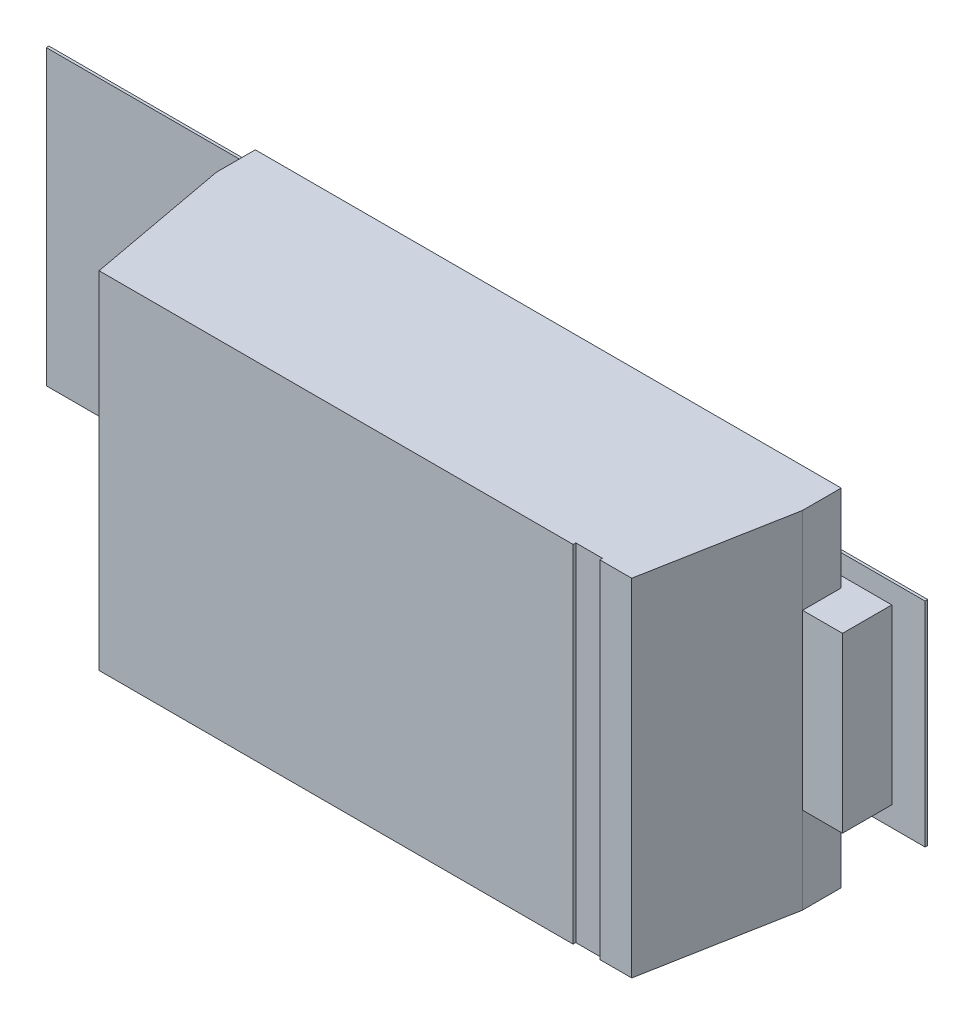
ISO-10303-21;
HEADER;
FILE_DESCRIPTION(('STEP AP214'),'2;1');
FILE_NAME('part.step','',(''),(''),'','','');
FILE_SCHEMA(('AUTOMOTIVE_DESIGN { 1 0 10303 214 1 1 1 1 }'));
ENDSEC;
DATA;
#1=APPLICATION_CONTEXT('core data for automotive mechanical design processes');
#2=APPLICATION_PROTOCOL_DEFINITION('international standard','automotive_design',2000,#1);
#3=PRODUCT_CONTEXT('',#1,'mechanical');
#4=PRODUCT('Part','Part','',(#3));
#5=PRODUCT_RELATED_PRODUCT_CATEGORY('part','',(#4));
#6=PRODUCT_DEFINITION_FORMATION('','',#4);
#7=PRODUCT_DEFINITION_CONTEXT('part definition',#1,'design');
#8=PRODUCT_DEFINITION('design','',#6,#7);
#9=PRODUCT_DEFINITION_SHAPE('','',#8);
#10=(LENGTH_UNIT() NAMED_UNIT(*) SI_UNIT(.MILLI.,.METRE.));
#11=(NAMED_UNIT(*) PLANE_ANGLE_UNIT() SI_UNIT($,.RADIAN.));
#12=(NAMED_UNIT(*) SI_UNIT($,.STERADIAN.) SOLID_ANGLE_UNIT());
#13=UNCERTAINTY_MEASURE_WITH_UNIT(LENGTH_MEASURE(1.E-05),#10,'distance_accuracy_value','');
#14=(GEOMETRIC_REPRESENTATION_CONTEXT(3) GLOBAL_UNCERTAINTY_ASSIGNED_CONTEXT((#13)) GLOBAL_UNIT_ASSIGNED_CONTEXT((#10,
#11,#12)) REPRESENTATION_CONTEXT('',''));
#15=CARTESIAN_POINT('',(0.,0.,0.));
#16=DIRECTION('',(0.,0.,1.));
#17=DIRECTION('',(1.,0.,0.));
#18=AXIS2_PLACEMENT_3D('',#15,#16,#17);
#19=CARTESIAN_POINT('',(-1.09999999999992,-0.64999999999994,0.272199999999978));
#20=DIRECTION('',(0.983318171348509,0.,-0.181893853375602));
#21=DIRECTION('',(0.,-1.,0.));
#22=AXIS2_PLACEMENT_3D('',#19,#20,#21);
#23=PLANE('',#22);
#24=DIRECTION('',(0.181893853375602,0.,0.983318171348509));
#25=VECTOR('',#24,1.);
#26=CARTESIAN_POINT('',(-1.09999999999992,0.64999999999994,0.272199999999978));
#27=LINE('',#26,#25);
#28=CARTESIAN_POINT('',(-1.09999999999992,0.64999999999994,0.272199999999978));
#29=VERTEX_POINT('',#28);
#30=CARTESIAN_POINT('',(-1.00000000000006,0.64999999999994,0.8128));
#31=VERTEX_POINT('',#30);
#32=EDGE_CURVE('E615',#29,#31,#27,.T.);
#33=ORIENTED_EDGE('',*,*,#32,.F.);
#34=DIRECTION('',(0.,-1.,0.));
#35=VECTOR('',#34,1.);
#36=CARTESIAN_POINT('',(-1.09999999999992,0.64999999999994,0.272199999999978));
#37=LINE('',#36,#35);
#38=CARTESIAN_POINT('',(-1.09999999999992,-0.64999999999994,0.272199999999978));
#39=VERTEX_POINT('',#38);
#40=EDGE_CURVE('E343',#29,#39,#37,.T.);
#41=ORIENTED_EDGE('',*,*,#40,.T.);
#42=DIRECTION('',(0.181893853375602,0.,0.983318171348509));
#43=VECTOR('',#42,1.);
#44=CARTESIAN_POINT('',(-1.09999999999992,-0.64999999999994,0.272199999999978));
#45=LINE('',#44,#43);
#46=CARTESIAN_POINT('',(-1.00000000000006,-0.64999999999994,0.8128));
#47=VERTEX_POINT('',#46);
#48=EDGE_CURVE('E384',#39,#47,#45,.T.);
#49=ORIENTED_EDGE('',*,*,#48,.T.);
#50=DIRECTION('',(0.,1.,0.));
#51=VECTOR('',#50,1.);
#52=CARTESIAN_POINT('',(-1.00000000000006,-0.64999999999994,0.8128));
#53=LINE('',#52,#51);
#54=EDGE_CURVE('E380',#47,#31,#53,.T.);
#55=ORIENTED_EDGE('',*,*,#54,.T.);
#56=EDGE_LOOP('',(#33,#41,#49,#55));
#57=FACE_BOUND('',#56,.T.);
#58=ADVANCED_FACE('F17',(#57),#23,.F.);
#59=CARTESIAN_POINT('',(1.25000000000008,-0.32499999999997,0.0762));
#60=DIRECTION('',(1.,0.,0.));
#61=DIRECTION('',(0.,1.,0.));
#62=AXIS2_PLACEMENT_3D('',#59,#60,#61);
#63=PLANE('',#62);
#64=DIRECTION('',(0.,1.,0.));
#65=VECTOR('',#64,1.);
#66=CARTESIAN_POINT('',(1.25000000000008,-0.32499999999997,0.0862000000000108));
#67=LINE('',#66,#65);
#68=CARTESIAN_POINT('',(1.25000000000008,-0.32499999999997,0.0862000000000108));
#69=VERTEX_POINT('',#68);
#70=CARTESIAN_POINT('',(1.25000000000008,0.32499999999997,0.0862000000000108));
#71=VERTEX_POINT('',#70);
#72=EDGE_CURVE('E312',#69,#71,#67,.T.);
#73=ORIENTED_EDGE('',*,*,#72,.T.);
#74=DIRECTION('',(0.,0.,1.));
#75=VECTOR('',#74,1.);
#76=CARTESIAN_POINT('',(1.25000000000008,0.32499999999997,0.0862000000000108));
#77=LINE('',#76,#75);
#78=CARTESIAN_POINT('',(1.25000000000008,0.32499999999997,0.271199999999982));
#79=VERTEX_POINT('',#78);
#80=EDGE_CURVE('E11',#71,#79,#77,.T.);
#81=ORIENTED_EDGE('',*,*,#80,.T.);
#82=DIRECTION('',(0.,1.,0.));
#83=VECTOR('',#82,1.);
#84=CARTESIAN_POINT('',(1.25000000000008,-0.32499999999997,0.271199999999982));
#85=LINE('',#84,#83);
#86=CARTESIAN_POINT('',(1.25000000000008,-0.32499999999997,0.271199999999982));
#87=VERTEX_POINT('',#86);
#88=EDGE_CURVE('E479',#87,#79,#85,.T.);
#89=ORIENTED_EDGE('',*,*,#88,.F.);
#90=DIRECTION('',(0.,0.,1.));
#91=VECTOR('',#90,1.);
#92=CARTESIAN_POINT('',(1.25000000000008,-0.32499999999997,0.0862000000000108));
#93=LINE('',#92,#91);
#94=EDGE_CURVE('E315',#69,#87,#93,.T.);
#95=ORIENTED_EDGE('',*,*,#94,.F.);
#96=EDGE_LOOP('',(#73,#81,#89,#95));
#97=FACE_BOUND('',#96,.T.);
#98=ADVANCED_FACE('F666',(#97),#63,.T.);
#99=CARTESIAN_POINT('',(1.25000000000008,0.32499999999997,0.0762));
#100=DIRECTION('',(0.,1.,0.));
#101=DIRECTION('',(1.,0.,0.));
#102=AXIS2_PLACEMENT_3D('',#99,#100,#101);
#103=PLANE('',#102);
#104=DIRECTION('',(-1.,0.,0.));
#105=VECTOR('',#104,1.);
#106=CARTESIAN_POINT('',(1.25000000000008,0.32499999999997,0.0862000000000108));
#107=LINE('',#106,#105);
#108=CARTESIAN_POINT('',(0.599999999999886,0.32499999999997,0.0862000000000108));
#109=VERTEX_POINT('',#108);
#110=EDGE_CURVE('E300',#71,#109,#107,.T.);
#111=ORIENTED_EDGE('',*,*,#110,.T.);
#112=DIRECTION('',(0.,0.,1.));
#113=VECTOR('',#112,1.);
#114=CARTESIAN_POINT('',(0.599999999999886,0.32499999999997,0.0862000000000108));
#115=LINE('',#114,#113);
#116=CARTESIAN_POINT('',(0.599999999999886,0.32499999999997,0.126200000000003));
#117=VERTEX_POINT('',#116);
#118=EDGE_CURVE('E28',#109,#117,#115,.T.);
#119=ORIENTED_EDGE('',*,*,#118,.T.);
#120=DIRECTION('',(-1.,0.,0.));
#121=VECTOR('',#120,1.);
#122=CARTESIAN_POINT('',(1.09999999999992,0.32499999999997,0.126200000000003));
#123=LINE('',#122,#121);
#124=CARTESIAN_POINT('',(1.09999999999992,0.32499999999997,0.126200000000003));
#125=VERTEX_POINT('',#124);
#126=EDGE_CURVE('E491',#125,#117,#123,.T.);
#127=ORIENTED_EDGE('',*,*,#126,.F.);
#128=DIRECTION('',(0.,0.,1.));
#129=VECTOR('',#128,1.);
#130=CARTESIAN_POINT('',(1.09999999999992,0.32499999999997,0.126200000000003));
#131=LINE('',#130,#129);
#132=CARTESIAN_POINT('',(1.09999999999992,0.32499999999997,0.271199999999982));
#133=VERTEX_POINT('',#132);
#134=EDGE_CURVE('E413',#125,#133,#131,.T.);
#135=ORIENTED_EDGE('',*,*,#134,.T.);
#136=DIRECTION('',(-1.,0.,0.));
#137=VECTOR('',#136,1.);
#138=CARTESIAN_POINT('',(1.25000000000008,0.32499999999997,0.271199999999982));
#139=LINE('',#138,#137);
#140=EDGE_CURVE('E344',#79,#133,#139,.T.);
#141=ORIENTED_EDGE('',*,*,#140,.F.);
#142=ORIENTED_EDGE('',*,*,#80,.F.);
#143=EDGE_LOOP('',(#111,#119,#127,#135,#141,#142));
#144=FACE_BOUND('',#143,.T.);
#145=ADVANCED_FACE('F19',(#144),#103,.T.);
#146=CARTESIAN_POINT('',(0.599999999999886,0.32499999999997,0.0762));
#147=DIRECTION('',(-1.,0.,0.));
#148=DIRECTION('',(0.,0.,1.));
#149=AXIS2_PLACEMENT_3D('',#146,#147,#148);
#150=PLANE('',#149);
#151=DIRECTION('',(0.,-1.,0.));
#152=VECTOR('',#151,1.);
#153=CARTESIAN_POINT('',(0.599999999999886,0.32499999999997,0.0862000000000108));
#154=LINE('',#153,#152);
#155=CARTESIAN_POINT('',(0.599999999999886,-0.32499999999997,0.0862000000000108));
#156=VERTEX_POINT('',#155);
#157=EDGE_CURVE('E292',#109,#156,#154,.T.);
#158=ORIENTED_EDGE('',*,*,#157,.T.);
#159=DIRECTION('',(0.,0.,1.));
#160=VECTOR('',#159,1.);
#161=CARTESIAN_POINT('',(0.599999999999886,-0.32499999999997,0.0862000000000108));
#162=LINE('',#161,#160);
#163=CARTESIAN_POINT('',(0.599999999999886,-0.32499999999997,0.126200000000003));
#164=VERTEX_POINT('',#163);
#165=EDGE_CURVE('E295',#156,#164,#162,.T.);
#166=ORIENTED_EDGE('',*,*,#165,.T.);
#167=DIRECTION('',(0.,-1.,0.));
#168=VECTOR('',#167,1.);
#169=CARTESIAN_POINT('',(0.599999999999886,0.32499999999997,0.126200000000003));
#170=LINE('',#169,#168);
#171=EDGE_CURVE('E561',#117,#164,#170,.T.);
#172=ORIENTED_EDGE('',*,*,#171,.F.);
#173=ORIENTED_EDGE('',*,*,#118,.F.);
#174=EDGE_LOOP('',(#158,#166,#172,#173));
#175=FACE_BOUND('',#174,.T.);
#176=ADVANCED_FACE('F294',(#175),#150,.T.);
#177=CARTESIAN_POINT('',(1.09999999999992,-0.64999999999994,0.126200000000003));
#178=DIRECTION('',(0.,0.,1.));
#179=DIRECTION('',(1.,0.,0.));
#180=AXIS2_PLACEMENT_3D('',#177,#178,#179);
#181=PLANE('',#180);
#182=DIRECTION('',(1.,0.,0.));
#183=VECTOR('',#182,1.);
#184=CARTESIAN_POINT('',(-1.09999999999992,-0.32499999999997,0.126200000000003));
#185=LINE('',#184,#183);
#186=CARTESIAN_POINT('',(-1.09999999999992,-0.32499999999997,0.126200000000003));
#187=VERTEX_POINT('',#186);
#188=CARTESIAN_POINT('',(0.0500000000000032,-0.32499999999997,0.126200000000003));
#189=VERTEX_POINT('',#188);
#190=EDGE_CURVE('E349',#187,#189,#185,.T.);
#191=ORIENTED_EDGE('',*,*,#190,.T.);
#192=DIRECTION('',(0.,1.,0.));
#193=VECTOR('',#192,1.);
#194=CARTESIAN_POINT('',(0.0500000000000032,-0.32499999999997,0.126200000000003));
#195=LINE('',#194,#193);
#196=CARTESIAN_POINT('',(0.0500000000000032,0.32499999999997,0.126200000000003));
#197=VERTEX_POINT('',#196);
#198=EDGE_CURVE('E350',#189,#197,#195,.T.);
#199=ORIENTED_EDGE('',*,*,#198,.T.);
#200=DIRECTION('',(1.,0.,0.));
#201=VECTOR('',#200,1.);
#202=CARTESIAN_POINT('',(-1.09999999999992,0.32499999999997,0.126200000000003));
#203=LINE('',#202,#201);
#204=CARTESIAN_POINT('',(-1.09999999999992,0.32499999999997,0.126200000000003));
#205=VERTEX_POINT('',#204);
#206=EDGE_CURVE('E431',#205,#197,#203,.T.);
#207=ORIENTED_EDGE('',*,*,#206,.F.);
#208=DIRECTION('',(0.,-1.,0.));
#209=VECTOR('',#208,1.);
#210=CARTESIAN_POINT('',(-1.09999999999992,0.64999999999994,0.126200000000003));
#211=LINE('',#210,#209);
#212=CARTESIAN_POINT('',(-1.09999999999992,0.64999999999994,0.126200000000003));
#213=VERTEX_POINT('',#212);
#214=EDGE_CURVE('E482',#213,#205,#211,.T.);
#215=ORIENTED_EDGE('',*,*,#214,.F.);
#216=DIRECTION('',(-1.,0.,0.));
#217=VECTOR('',#216,1.);
#218=CARTESIAN_POINT('',(1.09999999999992,0.64999999999994,0.126200000000003));
#219=LINE('',#218,#217);
#220=CARTESIAN_POINT('',(1.09999999999992,0.64999999999994,0.126200000000003));
#221=VERTEX_POINT('',#220);
#222=EDGE_CURVE('E487',#221,#213,#219,.T.);
#223=ORIENTED_EDGE('',*,*,#222,.F.);
#224=DIRECTION('',(0.,1.,0.));
#225=VECTOR('',#224,1.);
#226=CARTESIAN_POINT('',(1.09999999999992,0.32499999999997,0.126200000000003));
#227=LINE('',#226,#225);
#228=EDGE_CURVE('E324',#125,#221,#227,.T.);
#229=ORIENTED_EDGE('',*,*,#228,.F.);
#230=ORIENTED_EDGE('',*,*,#126,.T.);
#231=ORIENTED_EDGE('',*,*,#171,.T.);
#232=DIRECTION('',(-1.,0.,0.));
#233=VECTOR('',#232,1.);
#234=CARTESIAN_POINT('',(1.09999999999992,-0.32499999999997,0.126200000000003));
#235=LINE('',#234,#233);
#236=CARTESIAN_POINT('',(1.09999999999992,-0.32499999999997,0.126200000000003));
#237=VERTEX_POINT('',#236);
#238=EDGE_CURVE('E284',#237,#164,#235,.T.);
#239=ORIENTED_EDGE('',*,*,#238,.F.);
#240=DIRECTION('',(0.,1.,0.));
#241=VECTOR('',#240,1.);
#242=CARTESIAN_POINT('',(1.09999999999992,-0.64999999999994,0.126200000000003));
#243=LINE('',#242,#241);
#244=CARTESIAN_POINT('',(1.09999999999992,-0.64999999999994,0.126200000000003));
#245=VERTEX_POINT('',#244);
#246=EDGE_CURVE('E316',#245,#237,#243,.T.);
#247=ORIENTED_EDGE('',*,*,#246,.F.);
#248=DIRECTION('',(1.,0.,0.));
#249=VECTOR('',#248,1.);
#250=CARTESIAN_POINT('',(-1.09999999999992,-0.64999999999994,0.126200000000003));
#251=LINE('',#250,#249);
#252=CARTESIAN_POINT('',(-1.09999999999992,-0.64999999999994,0.126200000000003));
#253=VERTEX_POINT('',#252);
#254=EDGE_CURVE('E362',#253,#245,#251,.T.);
#255=ORIENTED_EDGE('',*,*,#254,.F.);
#256=DIRECTION('',(0.,-1.,0.));
#257=VECTOR('',#256,1.);
#258=CARTESIAN_POINT('',(-1.09999999999992,-0.32499999999997,0.126200000000003));
#259=LINE('',#258,#257);
#260=EDGE_CURVE('E340',#187,#253,#259,.T.);
#261=ORIENTED_EDGE('',*,*,#260,.F.);
#262=EDGE_LOOP('',(#191,#199,#207,#215,#223,#229,#230,#231,#239,#247,#255,#261));
#263=FACE_BOUND('',#262,.T.);
#264=ADVANCED_FACE('F646',(#263),#181,.F.);
#265=CARTESIAN_POINT('',(-1.09999999999992,0.64999999999994,0.0762));
#266=DIRECTION('',(-1.,0.,0.));
#267=DIRECTION('',(0.,0.,1.));
#268=AXIS2_PLACEMENT_3D('',#265,#266,#267);
#269=PLANE('',#268);
#270=DIRECTION('',(0.,0.,1.));
#271=VECTOR('',#270,1.);
#272=CARTESIAN_POINT('',(-1.09999999999992,-0.32499999999997,0.126200000000003));
#273=LINE('',#272,#271);
#274=CARTESIAN_POINT('',(-1.09999999999992,-0.32499999999997,0.271199999999982));
#275=VERTEX_POINT('',#274);
#276=EDGE_CURVE('E476',#187,#275,#273,.T.);
#277=ORIENTED_EDGE('',*,*,#276,.F.);
#278=ORIENTED_EDGE('',*,*,#260,.T.);
#279=DIRECTION('',(0.,0.,1.));
#280=VECTOR('',#279,1.);
#281=CARTESIAN_POINT('',(-1.09999999999992,-0.64999999999994,0.126200000000003));
#282=LINE('',#281,#280);
#283=EDGE_CURVE('E390',#253,#39,#282,.T.);
#284=ORIENTED_EDGE('',*,*,#283,.T.);
#285=ORIENTED_EDGE('',*,*,#40,.F.);
#286=DIRECTION('',(0.,0.,1.));
#287=VECTOR('',#286,1.);
#288=CARTESIAN_POINT('',(-1.09999999999992,0.64999999999994,0.126200000000003));
#289=LINE('',#288,#287);
#290=EDGE_CURVE('E596',#213,#29,#289,.T.);
#291=ORIENTED_EDGE('',*,*,#290,.F.);
#292=ORIENTED_EDGE('',*,*,#214,.T.);
#293=DIRECTION('',(0.,0.,1.));
#294=VECTOR('',#293,1.);
#295=CARTESIAN_POINT('',(-1.09999999999992,0.32499999999997,0.126200000000003));
#296=LINE('',#295,#294);
#297=CARTESIAN_POINT('',(-1.09999999999992,0.32499999999997,0.271199999999982));
#298=VERTEX_POINT('',#297);
#299=EDGE_CURVE('E427',#205,#298,#296,.T.);
#300=ORIENTED_EDGE('',*,*,#299,.T.);
#301=DIRECTION('',(0.,1.,0.));
#302=VECTOR('',#301,1.);
#303=CARTESIAN_POINT('',(-1.09999999999992,-0.32499999999997,0.271199999999982));
#304=LINE('',#303,#302);
#305=EDGE_CURVE('E569',#275,#298,#304,.T.);
#306=ORIENTED_EDGE('',*,*,#305,.F.);
#307=EDGE_LOOP('',(#277,#278,#284,#285,#291,#292,#300,#306));
#308=FACE_BOUND('',#307,.T.);
#309=ADVANCED_FACE('F641',(#308),#269,.T.);
#310=CARTESIAN_POINT('',(0.,0.,0.271199999999982));
#311=DIRECTION('',(0.,0.,1.));
#312=DIRECTION('',(1.,0.,0.));
#313=AXIS2_PLACEMENT_3D('',#310,#311,#312);
#314=PLANE('',#313);
#315=DIRECTION('',(1.,0.,0.));
#316=VECTOR('',#315,1.);
#317=CARTESIAN_POINT('',(1.09999999999992,-0.32499999999997,0.271199999999982));
#318=LINE('',#317,#316);
#319=CARTESIAN_POINT('',(1.09999999999992,-0.32499999999997,0.271199999999982));
#320=VERTEX_POINT('',#319);
#321=EDGE_CURVE('E270',#320,#87,#318,.T.);
#322=ORIENTED_EDGE('',*,*,#321,.T.);
#323=ORIENTED_EDGE('',*,*,#88,.T.);
#324=ORIENTED_EDGE('',*,*,#140,.T.);
#325=DIRECTION('',(0.,1.,0.));
#326=VECTOR('',#325,1.);
#327=CARTESIAN_POINT('',(1.09999999999992,-0.32499999999997,0.271199999999982));
#328=LINE('',#327,#326);
#329=EDGE_CURVE('E435',#320,#133,#328,.T.);
#330=ORIENTED_EDGE('',*,*,#329,.F.);
#331=EDGE_LOOP('',(#322,#323,#324,#330));
#332=FACE_BOUND('',#331,.T.);
#333=ADVANCED_FACE('F681',(#332),#314,.T.);
#334=CARTESIAN_POINT('',(0.,0.,0.271199999999982));
#335=DIRECTION('',(0.,0.,1.));
#336=DIRECTION('',(1.,0.,0.));
#337=AXIS2_PLACEMENT_3D('',#334,#335,#336);
#338=PLANE('',#337);
#339=DIRECTION('',(1.,0.,0.));
#340=VECTOR('',#339,1.);
#341=CARTESIAN_POINT('',(-1.25000000000008,-0.32499999999997,0.271199999999982));
#342=LINE('',#341,#340);
#343=CARTESIAN_POINT('',(-1.25000000000008,-0.32499999999997,0.271199999999982));
#344=VERTEX_POINT('',#343);
#345=EDGE_CURVE('E571',#344,#275,#342,.T.);
#346=ORIENTED_EDGE('',*,*,#345,.T.);
#347=ORIENTED_EDGE('',*,*,#305,.T.);
#348=DIRECTION('',(-1.,0.,0.));
#349=VECTOR('',#348,1.);
#350=CARTESIAN_POINT('',(-1.09999999999992,0.32499999999997,0.271199999999982));
#351=LINE('',#350,#349);
#352=CARTESIAN_POINT('',(-1.25000000000008,0.32499999999997,0.271199999999982));
#353=VERTEX_POINT('',#352);
#354=EDGE_CURVE('E370',#298,#353,#351,.T.);
#355=ORIENTED_EDGE('',*,*,#354,.T.);
#356=DIRECTION('',(0.,-1.,0.));
#357=VECTOR('',#356,1.);
#358=CARTESIAN_POINT('',(-1.25000000000008,0.32499999999997,0.271199999999982));
#359=LINE('',#358,#357);
#360=EDGE_CURVE('E371',#353,#344,#359,.T.);
#361=ORIENTED_EDGE('',*,*,#360,.T.);
#362=EDGE_LOOP('',(#346,#347,#355,#361));
#363=FACE_BOUND('',#362,.T.);
#364=ADVANCED_FACE('F678',(#363),#338,.T.);
#365=CARTESIAN_POINT('',(-1.25000000000008,-0.32499999999997,0.0762));
#366=DIRECTION('',(0.,-1.,0.));
#367=DIRECTION('',(0.,0.,-1.));
#368=AXIS2_PLACEMENT_3D('',#365,#366,#367);
#369=PLANE('',#368);
#370=DIRECTION('',(1.,0.,0.));
#371=VECTOR('',#370,1.);
#372=CARTESIAN_POINT('',(-1.25000000000008,-0.32499999999997,0.0862000000000108));
#373=LINE('',#372,#371);
#374=CARTESIAN_POINT('',(-1.25000000000008,-0.32499999999997,0.0862000000000108));
#375=VERTEX_POINT('',#374);
#376=CARTESIAN_POINT('',(0.0500000000000032,-0.32499999999997,0.0862000000000108));
#377=VERTEX_POINT('',#376);
#378=EDGE_CURVE('E459',#375,#377,#373,.T.);
#379=ORIENTED_EDGE('',*,*,#378,.T.);
#380=DIRECTION('',(0.,0.,1.));
#381=VECTOR('',#380,1.);
#382=CARTESIAN_POINT('',(0.0500000000000032,-0.32499999999997,0.0862000000000108));
#383=LINE('',#382,#381);
#384=EDGE_CURVE('E345',#377,#189,#383,.T.);
#385=ORIENTED_EDGE('',*,*,#384,.T.);
#386=ORIENTED_EDGE('',*,*,#190,.F.);
#387=ORIENTED_EDGE('',*,*,#276,.T.);
#388=ORIENTED_EDGE('',*,*,#345,.F.);
#389=DIRECTION('',(0.,0.,1.));
#390=VECTOR('',#389,1.);
#391=CARTESIAN_POINT('',(-1.25000000000008,-0.32499999999997,0.0862000000000108));
#392=LINE('',#391,#390);
#393=EDGE_CURVE('E612',#375,#344,#392,.T.);
#394=ORIENTED_EDGE('',*,*,#393,.F.);
#395=EDGE_LOOP('',(#379,#385,#386,#387,#388,#394));
#396=FACE_BOUND('',#395,.T.);
#397=ADVANCED_FACE('F656',(#396),#369,.T.);
#398=CARTESIAN_POINT('',(0.0500000000000032,-0.32499999999997,0.0762));
#399=DIRECTION('',(1.,0.,0.));
#400=DIRECTION('',(0.,1.,0.));
#401=AXIS2_PLACEMENT_3D('',#398,#399,#400);
#402=PLANE('',#401);
#403=DIRECTION('',(0.,1.,0.));
#404=VECTOR('',#403,1.);
#405=CARTESIAN_POINT('',(0.0500000000000032,-0.32499999999997,0.0862000000000108));
#406=LINE('',#405,#404);
#407=CARTESIAN_POINT('',(0.0500000000000032,0.32499999999997,0.0862000000000108));
#408=VERTEX_POINT('',#407);
#409=EDGE_CURVE('E542',#377,#408,#406,.T.);
#410=ORIENTED_EDGE('',*,*,#409,.T.);
#411=DIRECTION('',(0.,0.,1.));
#412=VECTOR('',#411,1.);
#413=CARTESIAN_POINT('',(0.0500000000000032,0.32499999999997,0.0862000000000108));
#414=LINE('',#413,#412);
#415=EDGE_CURVE('E416',#408,#197,#414,.T.);
#416=ORIENTED_EDGE('',*,*,#415,.T.);
#417=ORIENTED_EDGE('',*,*,#198,.F.);
#418=ORIENTED_EDGE('',*,*,#384,.F.);
#419=EDGE_LOOP('',(#410,#416,#417,#418));
#420=FACE_BOUND('',#419,.T.);
#421=ADVANCED_FACE('F741',(#420),#402,.T.);
#422=CARTESIAN_POINT('',(0.0500000000000032,0.32499999999997,0.0762));
#423=DIRECTION('',(0.,1.,0.));
#424=DIRECTION('',(1.,0.,0.));
#425=AXIS2_PLACEMENT_3D('',#422,#423,#424);
#426=PLANE('',#425);
#427=DIRECTION('',(-1.,0.,0.));
#428=VECTOR('',#427,1.);
#429=CARTESIAN_POINT('',(0.0500000000000032,0.32499999999997,0.0862000000000108));
#430=LINE('',#429,#428);
#431=CARTESIAN_POINT('',(-1.25000000000008,0.32499999999997,0.0862000000000108));
#432=VERTEX_POINT('',#431);
#433=EDGE_CURVE('E533',#408,#432,#430,.T.);
#434=ORIENTED_EDGE('',*,*,#433,.T.);
#435=DIRECTION('',(0.,0.,1.));
#436=VECTOR('',#435,1.);
#437=CARTESIAN_POINT('',(-1.25000000000008,0.32499999999997,0.0862000000000108));
#438=LINE('',#437,#436);
#439=EDGE_CURVE('E367',#432,#353,#438,.T.);
#440=ORIENTED_EDGE('',*,*,#439,.T.);
#441=ORIENTED_EDGE('',*,*,#354,.F.);
#442=ORIENTED_EDGE('',*,*,#299,.F.);
#443=ORIENTED_EDGE('',*,*,#206,.T.);
#444=ORIENTED_EDGE('',*,*,#415,.F.);
#445=EDGE_LOOP('',(#434,#440,#441,#442,#443,#444));
#446=FACE_BOUND('',#445,.T.);
#447=ADVANCED_FACE('F652',(#446),#426,.T.);
#448=CARTESIAN_POINT('',(-1.25000000000008,0.32499999999997,0.0762));
#449=DIRECTION('',(-1.,0.,0.));
#450=DIRECTION('',(0.,0.,1.));
#451=AXIS2_PLACEMENT_3D('',#448,#449,#450);
#452=PLANE('',#451);
#453=DIRECTION('',(0.,-1.,0.));
#454=VECTOR('',#453,1.);
#455=CARTESIAN_POINT('',(-1.25000000000008,0.32499999999997,0.0862000000000108));
#456=LINE('',#455,#454);
#457=EDGE_CURVE('E525',#432,#375,#456,.T.);
#458=ORIENTED_EDGE('',*,*,#457,.T.);
#459=ORIENTED_EDGE('',*,*,#393,.T.);
#460=ORIENTED_EDGE('',*,*,#360,.F.);
#461=ORIENTED_EDGE('',*,*,#439,.F.);
#462=EDGE_LOOP('',(#458,#459,#460,#461));
#463=FACE_BOUND('',#462,.T.);
#464=ADVANCED_FACE('F724',(#463),#452,.T.);
#465=CARTESIAN_POINT('',(1.37500000000009,0.399999999999924,0.0762));
#466=DIRECTION('',(0.,1.,0.));
#467=DIRECTION('',(1.,0.,0.));
#468=AXIS2_PLACEMENT_3D('',#465,#466,#467);
#469=PLANE('',#468);
#470=DIRECTION('',(-1.,0.,0.));
#471=VECTOR('',#470,1.);
#472=CARTESIAN_POINT('',(1.37500000000009,0.399999999999924,0.0762));
#473=LINE('',#472,#471);
#474=CARTESIAN_POINT('',(1.37500000000009,0.399999999999924,0.0762));
#475=VERTEX_POINT('',#474);
#476=CARTESIAN_POINT('',(0.574999999999986,0.399999999999924,0.0762));
#477=VERTEX_POINT('',#476);
#478=EDGE_CURVE('E334',#475,#477,#473,.T.);
#479=ORIENTED_EDGE('',*,*,#478,.T.);
#480=DIRECTION('',(0.,0.,1.));
#481=VECTOR('',#480,1.);
#482=CARTESIAN_POINT('',(0.574999999999986,0.399999999999924,0.0762));
#483=LINE('',#482,#481);
#484=CARTESIAN_POINT('',(0.574999999999986,0.399999999999924,0.0862000000000108));
#485=VERTEX_POINT('',#484);
#486=EDGE_CURVE('E437',#477,#485,#483,.T.);
#487=ORIENTED_EDGE('',*,*,#486,.T.);
#488=DIRECTION('',(-1.,0.,0.));
#489=VECTOR('',#488,1.);
#490=CARTESIAN_POINT('',(1.37500000000009,0.399999999999924,0.0862000000000108));
#491=LINE('',#490,#489);
#492=CARTESIAN_POINT('',(1.37500000000009,0.399999999999924,0.0862000000000108));
#493=VERTEX_POINT('',#492);
#494=EDGE_CURVE('E301',#493,#485,#491,.T.);
#495=ORIENTED_EDGE('',*,*,#494,.F.);
#496=DIRECTION('',(0.,0.,1.));
#497=VECTOR('',#496,1.);
#498=CARTESIAN_POINT('',(1.37500000000009,0.399999999999924,0.0762));
#499=LINE('',#498,#497);
#500=EDGE_CURVE('E189',#475,#493,#499,.T.);
#501=ORIENTED_EDGE('',*,*,#500,.F.);
#502=EDGE_LOOP('',(#479,#487,#495,#501));
#503=FACE_BOUND('',#502,.T.);
#504=ADVANCED_FACE('F712',(#503),#469,.T.);
#505=CARTESIAN_POINT('',(1.37500000000009,-0.399999999999924,0.0762));
#506=DIRECTION('',(1.,0.,0.));
#507=DIRECTION('',(0.,1.,0.));
#508=AXIS2_PLACEMENT_3D('',#505,#506,#507);
#509=PLANE('',#508);
#510=DIRECTION('',(0.,1.,0.));
#511=VECTOR('',#510,1.);
#512=CARTESIAN_POINT('',(1.37500000000009,-0.399999999999924,0.0762));
#513=LINE('',#512,#511);
#514=CARTESIAN_POINT('',(1.37500000000009,-0.399999999999924,0.0762));
#515=VERTEX_POINT('',#514);
#516=EDGE_CURVE('E417',#515,#475,#513,.T.);
#517=ORIENTED_EDGE('',*,*,#516,.T.);
#518=ORIENTED_EDGE('',*,*,#500,.T.);
#519=DIRECTION('',(0.,1.,0.));
#520=VECTOR('',#519,1.);
#521=CARTESIAN_POINT('',(1.37500000000009,-0.399999999999924,0.0862000000000108));
#522=LINE('',#521,#520);
#523=CARTESIAN_POINT('',(1.37500000000009,-0.399999999999924,0.0862000000000108));
#524=VERTEX_POINT('',#523);
#525=EDGE_CURVE('E366',#524,#493,#522,.T.);
#526=ORIENTED_EDGE('',*,*,#525,.F.);
#527=DIRECTION('',(0.,0.,1.));
#528=VECTOR('',#527,1.);
#529=CARTESIAN_POINT('',(1.37500000000009,-0.399999999999924,0.0762));
#530=LINE('',#529,#528);
#531=EDGE_CURVE('E591',#515,#524,#530,.T.);
#532=ORIENTED_EDGE('',*,*,#531,.F.);
#533=EDGE_LOOP('',(#517,#518,#526,#532));
#534=FACE_BOUND('',#533,.T.);
#535=ADVANCED_FACE('F709',(#534),#509,.T.);
#536=CARTESIAN_POINT('',(0.574999999999986,-0.399999999999924,0.0762));
#537=DIRECTION('',(0.,-1.,0.));
#538=DIRECTION('',(0.,0.,-1.));
#539=AXIS2_PLACEMENT_3D('',#536,#537,#538);
#540=PLANE('',#539);
#541=DIRECTION('',(1.,0.,0.));
#542=VECTOR('',#541,1.);
#543=CARTESIAN_POINT('',(0.574999999999986,-0.399999999999924,0.0762));
#544=LINE('',#543,#542);
#545=CARTESIAN_POINT('',(0.574999999999986,-0.399999999999924,0.0762));
#546=VERTEX_POINT('',#545);
#547=EDGE_CURVE('E420',#546,#515,#544,.T.);
#548=ORIENTED_EDGE('',*,*,#547,.T.);
#549=ORIENTED_EDGE('',*,*,#531,.T.);
#550=DIRECTION('',(1.,0.,0.));
#551=VECTOR('',#550,1.);
#552=CARTESIAN_POINT('',(0.574999999999986,-0.399999999999924,0.0862000000000108));
#553=LINE('',#552,#551);
#554=CARTESIAN_POINT('',(0.574999999999986,-0.399999999999924,0.0862000000000108));
#555=VERTEX_POINT('',#554);
#556=EDGE_CURVE('E537',#555,#524,#553,.T.);
#557=ORIENTED_EDGE('',*,*,#556,.F.);
#558=DIRECTION('',(0.,0.,1.));
#559=VECTOR('',#558,1.);
#560=CARTESIAN_POINT('',(0.574999999999986,-0.399999999999924,0.0762));
#561=LINE('',#560,#559);
#562=EDGE_CURVE('E440',#546,#555,#561,.T.);
#563=ORIENTED_EDGE('',*,*,#562,.F.);
#564=EDGE_LOOP('',(#548,#549,#557,#563));
#565=FACE_BOUND('',#564,.T.);
#566=ADVANCED_FACE('F707',(#565),#540,.T.);
#567=CARTESIAN_POINT('',(-1.92499999999992,0.550000000000086,0.0762));
#568=DIRECTION('',(-1.,0.,0.));
#569=DIRECTION('',(0.,0.,1.));
#570=AXIS2_PLACEMENT_3D('',#567,#568,#569);
#571=PLANE('',#570);
#572=DIRECTION('',(0.,-1.,0.));
#573=VECTOR('',#572,1.);
#574=CARTESIAN_POINT('',(-1.92499999999992,0.550000000000086,0.0762));
#575=LINE('',#574,#573);
#576=CARTESIAN_POINT('',(-1.92499999999992,0.550000000000086,0.0762));
#577=VERTEX_POINT('',#576);
#578=CARTESIAN_POINT('',(-1.92499999999992,-0.550000000000086,0.0762));
#579=VERTEX_POINT('',#578);
#580=EDGE_CURVE('E330',#577,#579,#575,.T.);
#581=ORIENTED_EDGE('',*,*,#580,.T.);
#582=DIRECTION('',(0.,0.,1.));
#583=VECTOR('',#582,1.);
#584=CARTESIAN_POINT('',(-1.92499999999992,-0.550000000000086,0.0762));
#585=LINE('',#584,#583);
#586=CARTESIAN_POINT('',(-1.92499999999992,-0.550000000000086,0.0862000000000108));
#587=VERTEX_POINT('',#586);
#588=EDGE_CURVE('E588',#579,#587,#585,.T.);
#589=ORIENTED_EDGE('',*,*,#588,.T.);
#590=DIRECTION('',(0.,-1.,0.));
#591=VECTOR('',#590,1.);
#592=CARTESIAN_POINT('',(-1.92499999999992,0.550000000000086,0.0862000000000108));
#593=LINE('',#592,#591);
#594=CARTESIAN_POINT('',(-1.92499999999992,0.550000000000086,0.0862000000000108));
#595=VERTEX_POINT('',#594);
#596=EDGE_CURVE('E389',#595,#587,#593,.T.);
#597=ORIENTED_EDGE('',*,*,#596,.F.);
#598=DIRECTION('',(0.,0.,1.));
#599=VECTOR('',#598,1.);
#600=CARTESIAN_POINT('',(-1.92499999999992,0.550000000000086,0.0762));
#601=LINE('',#600,#599);
#602=EDGE_CURVE('E509',#577,#595,#601,.T.);
#603=ORIENTED_EDGE('',*,*,#602,.F.);
#604=EDGE_LOOP('',(#581,#589,#597,#603));
#605=FACE_BOUND('',#604,.T.);
#606=ADVANCED_FACE('F704',(#605),#571,.T.);
#607=CARTESIAN_POINT('',(-1.92499999999992,-0.550000000000086,0.0762));
#608=DIRECTION('',(0.,-1.,0.));
#609=DIRECTION('',(0.,0.,-1.));
#610=AXIS2_PLACEMENT_3D('',#607,#608,#609);
#611=PLANE('',#610);
#612=DIRECTION('',(1.,0.,0.));
#613=VECTOR('',#612,1.);
#614=CARTESIAN_POINT('',(-1.92499999999992,-0.550000000000086,0.0762));
#615=LINE('',#614,#613);
#616=CARTESIAN_POINT('',(0.0750000000000048,-0.550000000000086,0.0762));
#617=VERTEX_POINT('',#616);
#618=EDGE_CURVE('E335',#579,#617,#615,.T.);
#619=ORIENTED_EDGE('',*,*,#618,.T.);
#620=DIRECTION('',(0.,0.,1.));
#621=VECTOR('',#620,1.);
#622=CARTESIAN_POINT('',(0.0750000000000048,-0.550000000000086,0.0762));
#623=LINE('',#622,#621);
#624=CARTESIAN_POINT('',(0.0750000000000048,-0.550000000000086,0.0862000000000108));
#625=VERTEX_POINT('',#624);
#626=EDGE_CURVE('E592',#617,#625,#623,.T.);
#627=ORIENTED_EDGE('',*,*,#626,.T.);
#628=DIRECTION('',(1.,0.,0.));
#629=VECTOR('',#628,1.);
#630=CARTESIAN_POINT('',(-1.92499999999992,-0.550000000000086,0.0862000000000108));
#631=LINE('',#630,#629);
#632=EDGE_CURVE('E515',#587,#625,#631,.T.);
#633=ORIENTED_EDGE('',*,*,#632,.F.);
#634=ORIENTED_EDGE('',*,*,#588,.F.);
#635=EDGE_LOOP('',(#619,#627,#633,#634));
#636=FACE_BOUND('',#635,.T.);
#637=ADVANCED_FACE('F676',(#636),#611,.T.);
#638=CARTESIAN_POINT('',(0.0750000000000048,-0.550000000000086,0.0762));
#639=DIRECTION('',(1.,0.,0.));
#640=DIRECTION('',(0.,1.,0.));
#641=AXIS2_PLACEMENT_3D('',#638,#639,#640);
#642=PLANE('',#641);
#643=DIRECTION('',(0.,1.,0.));
#644=VECTOR('',#643,1.);
#645=CARTESIAN_POINT('',(0.0750000000000048,-0.550000000000086,0.0762));
#646=LINE('',#645,#644);
#647=CARTESIAN_POINT('',(0.0750000000000048,0.550000000000086,0.0762));
#648=VERTEX_POINT('',#647);
#649=EDGE_CURVE('E339',#617,#648,#646,.T.);
#650=ORIENTED_EDGE('',*,*,#649,.T.);
#651=DIRECTION('',(0.,0.,1.));
#652=VECTOR('',#651,1.);
#653=CARTESIAN_POINT('',(0.0750000000000048,0.550000000000086,0.0762));
#654=LINE('',#653,#652);
#655=CARTESIAN_POINT('',(0.0750000000000048,0.550000000000086,0.0862000000000108));
#656=VERTEX_POINT('',#655);
#657=EDGE_CURVE('E597',#648,#656,#654,.T.);
#658=ORIENTED_EDGE('',*,*,#657,.T.);
#659=DIRECTION('',(0.,1.,0.));
#660=VECTOR('',#659,1.);
#661=CARTESIAN_POINT('',(0.0750000000000048,-0.550000000000086,0.0862000000000108));
#662=LINE('',#661,#660);
#663=EDGE_CURVE('E518',#625,#656,#662,.T.);
#664=ORIENTED_EDGE('',*,*,#663,.F.);
#665=ORIENTED_EDGE('',*,*,#626,.F.);
#666=EDGE_LOOP('',(#650,#658,#664,#665));
#667=FACE_BOUND('',#666,.T.);
#668=ADVANCED_FACE('F699',(#667),#642,.T.);
#669=CARTESIAN_POINT('',(0.0750000000000048,0.550000000000086,0.0762));
#670=DIRECTION('',(0.,1.,0.));
#671=DIRECTION('',(1.,0.,0.));
#672=AXIS2_PLACEMENT_3D('',#669,#670,#671);
#673=PLANE('',#672);
#674=DIRECTION('',(-1.,0.,0.));
#675=VECTOR('',#674,1.);
#676=CARTESIAN_POINT('',(0.0750000000000048,0.550000000000086,0.0762));
#677=LINE('',#676,#675);
#678=EDGE_CURVE('E439',#648,#577,#677,.T.);
#679=ORIENTED_EDGE('',*,*,#678,.T.);
#680=ORIENTED_EDGE('',*,*,#602,.T.);
#681=DIRECTION('',(-1.,0.,0.));
#682=VECTOR('',#681,1.);
#683=CARTESIAN_POINT('',(0.0750000000000048,0.550000000000086,0.0862000000000108));
#684=LINE('',#683,#682);
#685=EDGE_CURVE('E386',#656,#595,#684,.T.);
#686=ORIENTED_EDGE('',*,*,#685,.F.);
#687=ORIENTED_EDGE('',*,*,#657,.F.);
#688=EDGE_LOOP('',(#679,#680,#686,#687));
#689=FACE_BOUND('',#688,.T.);
#690=ADVANCED_FACE('F695',(#689),#673,.T.);
#691=CARTESIAN_POINT('',(0.,0.,0.0762));
#692=DIRECTION('',(0.,0.,1.));
#693=DIRECTION('',(1.,0.,0.));
#694=AXIS2_PLACEMENT_3D('',#691,#692,#693);
#695=PLANE('',#694);
#696=DIRECTION('',(0.,-1.,0.));
#697=VECTOR('',#696,1.);
#698=CARTESIAN_POINT('',(0.574999999999986,0.399999999999924,0.0762));
#699=LINE('',#698,#697);
#700=EDGE_CURVE('E449',#477,#546,#699,.T.);
#701=ORIENTED_EDGE('',*,*,#700,.F.);
#702=ORIENTED_EDGE('',*,*,#478,.F.);
#703=ORIENTED_EDGE('',*,*,#516,.F.);
#704=ORIENTED_EDGE('',*,*,#547,.F.);
#705=EDGE_LOOP('',(#701,#702,#703,#704));
#706=FACE_BOUND('',#705,.T.);
#707=ADVANCED_FACE('F691',(#706),#695,.F.);
#708=CARTESIAN_POINT('',(0.,0.,0.0762));
#709=DIRECTION('',(0.,0.,1.));
#710=DIRECTION('',(1.,0.,0.));
#711=AXIS2_PLACEMENT_3D('',#708,#709,#710);
#712=PLANE('',#711);
#713=ORIENTED_EDGE('',*,*,#678,.F.);
#714=ORIENTED_EDGE('',*,*,#649,.F.);
#715=ORIENTED_EDGE('',*,*,#618,.F.);
#716=ORIENTED_EDGE('',*,*,#580,.F.);
#717=EDGE_LOOP('',(#713,#714,#715,#716));
#718=FACE_BOUND('',#717,.T.);
#719=ADVANCED_FACE('F694',(#718),#712,.F.);
#720=CARTESIAN_POINT('',(0.574999999999986,0.399999999999924,0.0762));
#721=DIRECTION('',(-1.,0.,0.));
#722=DIRECTION('',(0.,0.,1.));
#723=AXIS2_PLACEMENT_3D('',#720,#721,#722);
#724=PLANE('',#723);
#725=ORIENTED_EDGE('',*,*,#700,.T.);
#726=ORIENTED_EDGE('',*,*,#562,.T.);
#727=DIRECTION('',(0.,-1.,0.));
#728=VECTOR('',#727,1.);
#729=CARTESIAN_POINT('',(0.574999999999986,0.399999999999924,0.0862000000000108));
#730=LINE('',#729,#728);
#731=EDGE_CURVE('E307',#485,#555,#730,.T.);
#732=ORIENTED_EDGE('',*,*,#731,.F.);
#733=ORIENTED_EDGE('',*,*,#486,.F.);
#734=EDGE_LOOP('',(#725,#726,#732,#733));
#735=FACE_BOUND('',#734,.T.);
#736=ADVANCED_FACE('F748',(#735),#724,.T.);
#737=CARTESIAN_POINT('',(0.,0.,0.0862000000000108));
#738=DIRECTION('',(0.,0.,1.));
#739=DIRECTION('',(1.,0.,0.));
#740=AXIS2_PLACEMENT_3D('',#737,#738,#739);
#741=PLANE('',#740);
#742=ORIENTED_EDGE('',*,*,#457,.F.);
#743=ORIENTED_EDGE('',*,*,#433,.F.);
#744=ORIENTED_EDGE('',*,*,#409,.F.);
#745=ORIENTED_EDGE('',*,*,#378,.F.);
#746=EDGE_LOOP('',(#742,#743,#744,#745));
#747=FACE_BOUND('',#746,.T.);
#748=ORIENTED_EDGE('',*,*,#685,.T.);
#749=ORIENTED_EDGE('',*,*,#596,.T.);
#750=ORIENTED_EDGE('',*,*,#632,.T.);
#751=ORIENTED_EDGE('',*,*,#663,.T.);
#752=EDGE_LOOP('',(#748,#749,#750,#751));
#753=FACE_BOUND('',#752,.T.);
#754=ADVANCED_FACE('F718',(#747,#753),#741,.T.);
#755=CARTESIAN_POINT('',(0.,0.,0.0862000000000108));
#756=DIRECTION('',(0.,0.,1.));
#757=DIRECTION('',(1.,0.,0.));
#758=AXIS2_PLACEMENT_3D('',#755,#756,#757);
#759=PLANE('',#758);
#760=ORIENTED_EDGE('',*,*,#157,.F.);
#761=ORIENTED_EDGE('',*,*,#110,.F.);
#762=ORIENTED_EDGE('',*,*,#72,.F.);
#763=DIRECTION('',(1.,0.,0.));
#764=VECTOR('',#763,1.);
#765=CARTESIAN_POINT('',(0.599999999999886,-0.32499999999997,0.0862000000000108));
#766=LINE('',#765,#764);
#767=EDGE_CURVE('E305',#156,#69,#766,.T.);
#768=ORIENTED_EDGE('',*,*,#767,.F.);
#769=EDGE_LOOP('',(#760,#761,#762,#768));
#770=FACE_BOUND('',#769,.T.);
#771=ORIENTED_EDGE('',*,*,#731,.T.);
#772=ORIENTED_EDGE('',*,*,#556,.T.);
#773=ORIENTED_EDGE('',*,*,#525,.T.);
#774=ORIENTED_EDGE('',*,*,#494,.T.);
#775=EDGE_LOOP('',(#771,#772,#773,#774));
#776=FACE_BOUND('',#775,.T.);
#777=ADVANCED_FACE('F309',(#770,#776),#759,.T.);
#778=CARTESIAN_POINT('',(0.599999999999886,-0.32499999999997,0.0762));
#779=DIRECTION('',(0.,-1.,0.));
#780=DIRECTION('',(0.,0.,-1.));
#781=AXIS2_PLACEMENT_3D('',#778,#779,#780);
#782=PLANE('',#781);
#783=ORIENTED_EDGE('',*,*,#767,.T.);
#784=ORIENTED_EDGE('',*,*,#94,.T.);
#785=ORIENTED_EDGE('',*,*,#321,.F.);
#786=DIRECTION('',(0.,0.,1.));
#787=VECTOR('',#786,1.);
#788=CARTESIAN_POINT('',(1.09999999999992,-0.32499999999997,0.126200000000003));
#789=LINE('',#788,#787);
#790=EDGE_CURVE('E432',#237,#320,#789,.T.);
#791=ORIENTED_EDGE('',*,*,#790,.F.);
#792=ORIENTED_EDGE('',*,*,#238,.T.);
#793=ORIENTED_EDGE('',*,*,#165,.F.);
#794=EDGE_LOOP('',(#783,#784,#785,#791,#792,#793));
#795=FACE_BOUND('',#794,.T.);
#796=ADVANCED_FACE('F304',(#795),#782,.T.);
#797=CARTESIAN_POINT('',(1.09999999999992,-0.64999999999994,0.0762));
#798=DIRECTION('',(1.,0.,0.));
#799=DIRECTION('',(0.,1.,0.));
#800=AXIS2_PLACEMENT_3D('',#797,#798,#799);
#801=PLANE('',#800);
#802=ORIENTED_EDGE('',*,*,#790,.T.);
#803=ORIENTED_EDGE('',*,*,#329,.T.);
#804=ORIENTED_EDGE('',*,*,#134,.F.);
#805=ORIENTED_EDGE('',*,*,#228,.T.);
#806=DIRECTION('',(0.,0.,1.));
#807=VECTOR('',#806,1.);
#808=CARTESIAN_POINT('',(1.09999999999992,0.64999999999994,0.126200000000003));
#809=LINE('',#808,#807);
#810=CARTESIAN_POINT('',(1.09999999999992,0.64999999999994,0.272199999999978));
#811=VERTEX_POINT('',#810);
#812=EDGE_CURVE('E483',#221,#811,#809,.T.);
#813=ORIENTED_EDGE('',*,*,#812,.T.);
#814=DIRECTION('',(0.,1.,0.));
#815=VECTOR('',#814,1.);
#816=CARTESIAN_POINT('',(1.09999999999992,-0.64999999999994,0.272199999999978));
#817=LINE('',#816,#815);
#818=CARTESIAN_POINT('',(1.09999999999992,-0.64999999999994,0.272199999999978));
#819=VERTEX_POINT('',#818);
#820=EDGE_CURVE('E436',#819,#811,#817,.T.);
#821=ORIENTED_EDGE('',*,*,#820,.F.);
#822=DIRECTION('',(0.,0.,1.));
#823=VECTOR('',#822,1.);
#824=CARTESIAN_POINT('',(1.09999999999992,-0.64999999999994,0.126200000000003));
#825=LINE('',#824,#823);
#826=EDGE_CURVE('E357',#245,#819,#825,.T.);
#827=ORIENTED_EDGE('',*,*,#826,.F.);
#828=ORIENTED_EDGE('',*,*,#246,.T.);
#829=EDGE_LOOP('',(#802,#803,#804,#805,#813,#821,#827,#828));
#830=FACE_BOUND('',#829,.T.);
#831=ADVANCED_FACE('F682',(#830),#801,.T.);
#832=CARTESIAN_POINT('',(1.00000000000006,-0.64999999999994,0.8128));
#833=DIRECTION('',(-0.983318171348509,0.,-0.181893853375602));
#834=DIRECTION('',(-0.181893853375602,0.,0.983318171348509));
#835=AXIS2_PLACEMENT_3D('',#832,#833,#834);
#836=PLANE('',#835);
#837=DIRECTION('',(0.181893853375602,0.,-0.983318171348509));
#838=VECTOR('',#837,1.);
#839=CARTESIAN_POINT('',(1.00000000000006,0.64999999999994,0.8128));
#840=LINE('',#839,#838);
#841=CARTESIAN_POINT('',(1.00000000000006,0.64999999999994,0.8128));
#842=VERTEX_POINT('',#841);
#843=EDGE_CURVE('E488',#842,#811,#840,.T.);
#844=ORIENTED_EDGE('',*,*,#843,.F.);
#845=DIRECTION('',(0.,1.,0.));
#846=VECTOR('',#845,1.);
#847=CARTESIAN_POINT('',(1.00000000000006,-0.64999999999994,0.8128));
#848=LINE('',#847,#846);
#849=CARTESIAN_POINT('',(1.00000000000006,-0.64999999999994,0.8128));
#850=VERTEX_POINT('',#849);
#851=EDGE_CURVE('E356',#850,#842,#848,.T.);
#852=ORIENTED_EDGE('',*,*,#851,.F.);
#853=DIRECTION('',(0.181893853375602,0.,-0.983318171348509));
#854=VECTOR('',#853,1.);
#855=CARTESIAN_POINT('',(1.00000000000006,-0.64999999999994,0.8128));
#856=LINE('',#855,#854);
#857=EDGE_CURVE('E361',#850,#819,#856,.T.);
#858=ORIENTED_EDGE('',*,*,#857,.T.);
#859=ORIENTED_EDGE('',*,*,#820,.T.);
#860=EDGE_LOOP('',(#844,#852,#858,#859));
#861=FACE_BOUND('',#860,.T.);
#862=ADVANCED_FACE('F685',(#861),#836,.F.);
#863=CARTESIAN_POINT('',(0.880000000000036,-0.64999999999994,0.8128));
#864=DIRECTION('',(1.,0.,0.));
#865=DIRECTION('',(0.,1.,0.));
#866=AXIS2_PLACEMENT_3D('',#863,#864,#865);
#867=PLANE('',#866);
#868=DIRECTION('',(0.,1.,0.));
#869=VECTOR('',#868,1.);
#870=CARTESIAN_POINT('',(0.880000000000036,-0.64999999999994,0.8128));
#871=LINE('',#870,#869);
#872=CARTESIAN_POINT('',(0.880000000000036,-0.64999999999994,0.8128));
#873=VERTEX_POINT('',#872);
#874=CARTESIAN_POINT('',(0.880000000000036,0.64999999999994,0.8128));
#875=VERTEX_POINT('',#874);
#876=EDGE_CURVE('E379',#873,#875,#871,.T.);
#877=ORIENTED_EDGE('',*,*,#876,.T.);
#878=DIRECTION('',(0.,0.,-1.));
#879=VECTOR('',#878,1.);
#880=CARTESIAN_POINT('',(0.880000000000036,0.64999999999994,0.8128));
#881=LINE('',#880,#879);
#882=CARTESIAN_POINT('',(0.880000000000036,0.64999999999994,0.80280000000004));
#883=VERTEX_POINT('',#882);
#884=EDGE_CURVE('E425',#875,#883,#881,.T.);
#885=ORIENTED_EDGE('',*,*,#884,.T.);
#886=DIRECTION('',(0.,1.,0.));
#887=VECTOR('',#886,1.);
#888=CARTESIAN_POINT('',(0.880000000000036,-0.64999999999994,0.80280000000004));
#889=LINE('',#888,#887);
#890=CARTESIAN_POINT('',(0.880000000000036,-0.64999999999994,0.80280000000004));
#891=VERTEX_POINT('',#890);
#892=EDGE_CURVE('E382',#891,#883,#889,.T.);
#893=ORIENTED_EDGE('',*,*,#892,.F.);
#894=DIRECTION('',(0.,0.,-1.));
#895=VECTOR('',#894,1.);
#896=CARTESIAN_POINT('',(0.880000000000036,-0.64999999999994,0.8128));
#897=LINE('',#896,#895);
#898=EDGE_CURVE('E21',#873,#891,#897,.T.);
#899=ORIENTED_EDGE('',*,*,#898,.F.);
#900=EDGE_LOOP('',(#877,#885,#893,#899));
#901=FACE_BOUND('',#900,.T.);
#902=ADVANCED_FACE('F689',(#901),#867,.F.);
#903=CARTESIAN_POINT('',(-1.09999999999992,-0.64999999999994,0.0762));
#904=DIRECTION('',(0.,-1.,0.));
#905=DIRECTION('',(0.,0.,-1.));
#906=AXIS2_PLACEMENT_3D('',#903,#904,#905);
#907=PLANE('',#906);
#908=DIRECTION('',(1.,0.,0.));
#909=VECTOR('',#908,1.);
#910=CARTESIAN_POINT('',(0.779999999999928,-0.64999999999994,0.80280000000004));
#911=LINE('',#910,#909);
#912=CARTESIAN_POINT('',(0.779999999999928,-0.64999999999994,0.80280000000004));
#913=VERTEX_POINT('',#912);
#914=EDGE_CURVE('E328',#913,#891,#911,.T.);
#915=ORIENTED_EDGE('',*,*,#914,.F.);
#916=DIRECTION('',(0.,0.,-1.));
#917=VECTOR('',#916,1.);
#918=CARTESIAN_POINT('',(0.779999999999928,-0.64999999999994,0.8128));
#919=LINE('',#918,#917);
#920=CARTESIAN_POINT('',(0.779999999999928,-0.64999999999994,0.8128));
#921=VERTEX_POINT('',#920);
#922=EDGE_CURVE('E355',#921,#913,#919,.T.);
#923=ORIENTED_EDGE('',*,*,#922,.F.);
#924=DIRECTION('',(1.,0.,0.));
#925=VECTOR('',#924,1.);
#926=CARTESIAN_POINT('',(-1.00000000000006,-0.64999999999994,0.8128));
#927=LINE('',#926,#925);
#928=EDGE_CURVE('E376',#47,#921,#927,.T.);
#929=ORIENTED_EDGE('',*,*,#928,.F.);
#930=ORIENTED_EDGE('',*,*,#48,.F.);
#931=ORIENTED_EDGE('',*,*,#283,.F.);
#932=ORIENTED_EDGE('',*,*,#254,.T.);
#933=ORIENTED_EDGE('',*,*,#826,.T.);
#934=ORIENTED_EDGE('',*,*,#857,.F.);
#935=DIRECTION('',(1.,0.,0.));
#936=VECTOR('',#935,1.);
#937=CARTESIAN_POINT('',(0.880000000000036,-0.64999999999994,0.8128));
#938=LINE('',#937,#936);
#939=EDGE_CURVE('E492',#873,#850,#938,.T.);
#940=ORIENTED_EDGE('',*,*,#939,.F.);
#941=ORIENTED_EDGE('',*,*,#898,.T.);
#942=EDGE_LOOP('',(#915,#923,#929,#930,#931,#932,#933,#934,#940,#941));
#943=FACE_BOUND('',#942,.T.);
#944=ADVANCED_FACE('F659',(#943),#907,.T.);
#945=CARTESIAN_POINT('',(0.,0.,0.80280000000004));
#946=DIRECTION('',(0.,0.,1.));
#947=DIRECTION('',(1.,0.,0.));
#948=AXIS2_PLACEMENT_3D('',#945,#946,#947);
#949=PLANE('',#948);
#950=ORIENTED_EDGE('',*,*,#914,.T.);
#951=ORIENTED_EDGE('',*,*,#892,.T.);
#952=DIRECTION('',(1.,0.,0.));
#953=VECTOR('',#952,1.);
#954=CARTESIAN_POINT('',(0.779999999999928,0.64999999999994,0.80280000000004));
#955=LINE('',#954,#953);
#956=CARTESIAN_POINT('',(0.779999999999928,0.64999999999994,0.80280000000004));
#957=VERTEX_POINT('',#956);
#958=EDGE_CURVE('E421',#957,#883,#955,.T.);
#959=ORIENTED_EDGE('',*,*,#958,.F.);
#960=DIRECTION('',(0.,-1.,0.));
#961=VECTOR('',#960,1.);
#962=CARTESIAN_POINT('',(0.779999999999928,0.64999999999994,0.80280000000004));
#963=LINE('',#962,#961);
#964=EDGE_CURVE('E500',#957,#913,#963,.T.);
#965=ORIENTED_EDGE('',*,*,#964,.T.);
#966=EDGE_LOOP('',(#950,#951,#959,#965));
#967=FACE_BOUND('',#966,.T.);
#968=ADVANCED_FACE('F736',(#967),#949,.T.);
#969=CARTESIAN_POINT('',(1.09999999999992,0.64999999999994,0.0762));
#970=DIRECTION('',(0.,1.,0.));
#971=DIRECTION('',(1.,0.,0.));
#972=AXIS2_PLACEMENT_3D('',#969,#970,#971);
#973=PLANE('',#972);
#974=ORIENTED_EDGE('',*,*,#958,.T.);
#975=ORIENTED_EDGE('',*,*,#884,.F.);
#976=DIRECTION('',(-1.,0.,0.));
#977=VECTOR('',#976,1.);
#978=CARTESIAN_POINT('',(1.00000000000006,0.64999999999994,0.8128));
#979=LINE('',#978,#977);
#980=EDGE_CURVE('E351',#842,#875,#979,.T.);
#981=ORIENTED_EDGE('',*,*,#980,.F.);
#982=ORIENTED_EDGE('',*,*,#843,.T.);
#983=ORIENTED_EDGE('',*,*,#812,.F.);
#984=ORIENTED_EDGE('',*,*,#222,.T.);
#985=ORIENTED_EDGE('',*,*,#290,.T.);
#986=ORIENTED_EDGE('',*,*,#32,.T.);
#987=DIRECTION('',(-1.,0.,0.));
#988=VECTOR('',#987,1.);
#989=CARTESIAN_POINT('',(0.779999999999928,0.64999999999994,0.8128));
#990=LINE('',#989,#988);
#991=CARTESIAN_POINT('',(0.779999999999928,0.64999999999994,0.8128));
#992=VERTEX_POINT('',#991);
#993=EDGE_CURVE('E468',#992,#31,#990,.T.);
#994=ORIENTED_EDGE('',*,*,#993,.F.);
#995=DIRECTION('',(0.,0.,-1.));
#996=VECTOR('',#995,1.);
#997=CARTESIAN_POINT('',(0.779999999999928,0.64999999999994,0.8128));
#998=LINE('',#997,#996);
#999=EDGE_CURVE('E426',#992,#957,#998,.T.);
#1000=ORIENTED_EDGE('',*,*,#999,.T.);
#1001=EDGE_LOOP('',(#974,#975,#981,#982,#983,#984,#985,#986,#994,#1000));
#1002=FACE_BOUND('',#1001,.T.);
#1003=ADVANCED_FACE('F635',(#1002),#973,.T.);
#1004=CARTESIAN_POINT('',(0.779999999999928,0.64999999999994,0.8128));
#1005=DIRECTION('',(-1.,0.,0.));
#1006=DIRECTION('',(0.,0.,1.));
#1007=AXIS2_PLACEMENT_3D('',#1004,#1005,#1006);
#1008=PLANE('',#1007);
#1009=DIRECTION('',(0.,1.,0.));
#1010=VECTOR('',#1009,1.);
#1011=CARTESIAN_POINT('',(0.779999999999928,-0.64999999999994,0.8128));
#1012=LINE('',#1011,#1010);
#1013=EDGE_CURVE('E496',#921,#992,#1012,.T.);
#1014=ORIENTED_EDGE('',*,*,#1013,.F.);
#1015=ORIENTED_EDGE('',*,*,#922,.T.);
#1016=ORIENTED_EDGE('',*,*,#964,.F.);
#1017=ORIENTED_EDGE('',*,*,#999,.F.);
#1018=EDGE_LOOP('',(#1014,#1015,#1016,#1017));
#1019=FACE_BOUND('',#1018,.T.);
#1020=ADVANCED_FACE('F728',(#1019),#1008,.F.);
#1021=CARTESIAN_POINT('',(0.,0.,0.8128));
#1022=DIRECTION('',(0.,0.,1.));
#1023=DIRECTION('',(1.,0.,0.));
#1024=AXIS2_PLACEMENT_3D('',#1021,#1022,#1023);
#1025=PLANE('',#1024);
#1026=ORIENTED_EDGE('',*,*,#876,.F.);
#1027=ORIENTED_EDGE('',*,*,#939,.T.);
#1028=ORIENTED_EDGE('',*,*,#851,.T.);
#1029=ORIENTED_EDGE('',*,*,#980,.T.);
#1030=EDGE_LOOP('',(#1026,#1027,#1028,#1029));
#1031=FACE_BOUND('',#1030,.T.);
#1032=ADVANCED_FACE('F703',(#1031),#1025,.T.);
#1033=CARTESIAN_POINT('',(0.,0.,0.8128));
#1034=DIRECTION('',(0.,0.,1.));
#1035=DIRECTION('',(1.,0.,0.));
#1036=AXIS2_PLACEMENT_3D('',#1033,#1034,#1035);
#1037=PLANE('',#1036);
#1038=ORIENTED_EDGE('',*,*,#1013,.T.);
#1039=ORIENTED_EDGE('',*,*,#993,.T.);
#1040=ORIENTED_EDGE('',*,*,#54,.F.);
#1041=ORIENTED_EDGE('',*,*,#928,.T.);
#1042=EDGE_LOOP('',(#1038,#1039,#1040,#1041));
#1043=FACE_BOUND('',#1042,.T.);
#1044=ADVANCED_FACE('F664',(#1043),#1037,.T.);
#1045=CLOSED_SHELL('',(#58,#98,#145,#176,#264,#309,#333,#364,#397,#421,#447,#464,#504,#535,#566,
#606,#637,#668,#690,#707,#719,#736,#754,#777,#796,#831,#862,#902,#944,#968,#1003,#1020,#1032,#1044));
#1046=MANIFOLD_SOLID_BREP('B1',#1045);
#1047=ADVANCED_BREP_SHAPE_REPRESENTATION('',(#18,#1046),#14);
#1048=SHAPE_DEFINITION_REPRESENTATION(#9,#1047);
ENDSEC;
END-ISO-10303-21;
